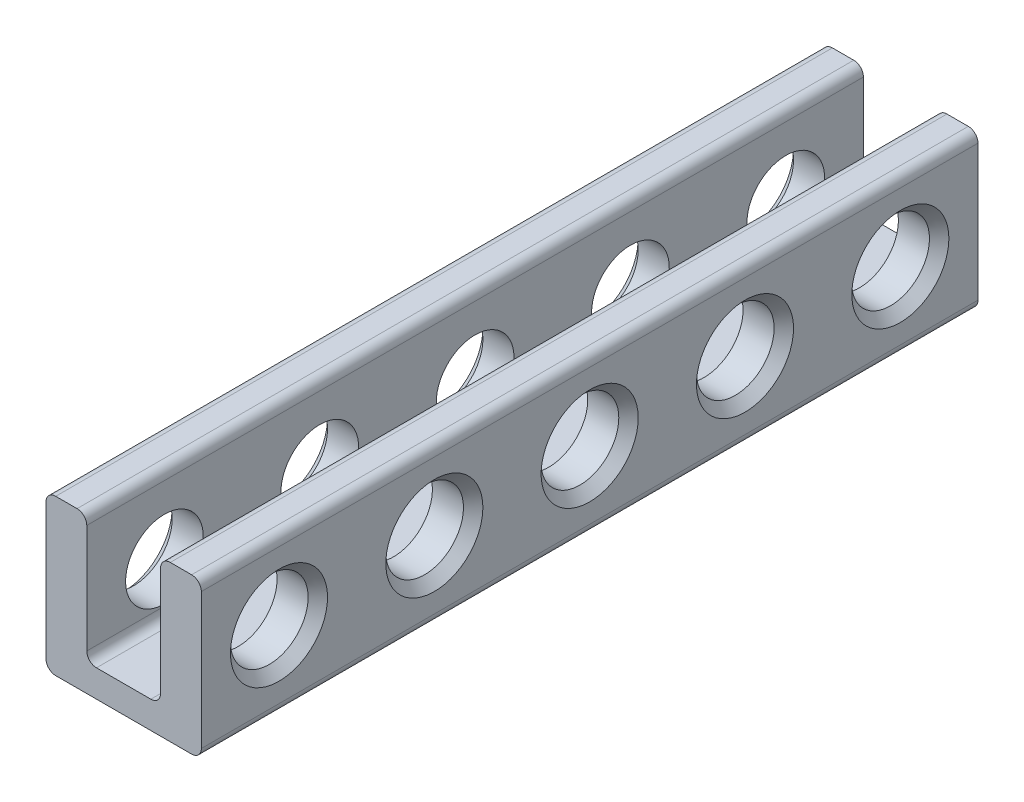
ISO-10303-21;
HEADER;
FILE_DESCRIPTION(('STEP AP214'),'2;1');
FILE_NAME('part.step','',(''),(''),'','','');
FILE_SCHEMA(('AUTOMOTIVE_DESIGN { 1 0 10303 214 1 1 1 1 }'));
ENDSEC;
DATA;
#1=APPLICATION_CONTEXT('core data for automotive mechanical design processes');
#2=APPLICATION_PROTOCOL_DEFINITION('international standard','automotive_design',2000,#1);
#3=PRODUCT_CONTEXT('',#1,'mechanical');
#4=PRODUCT('Part','Part','',(#3));
#5=PRODUCT_RELATED_PRODUCT_CATEGORY('part','',(#4));
#6=PRODUCT_DEFINITION_FORMATION('','',#4);
#7=PRODUCT_DEFINITION_CONTEXT('part definition',#1,'design');
#8=PRODUCT_DEFINITION('design','',#6,#7);
#9=PRODUCT_DEFINITION_SHAPE('','',#8);
#10=(LENGTH_UNIT() NAMED_UNIT(*) SI_UNIT(.MILLI.,.METRE.));
#11=(NAMED_UNIT(*) PLANE_ANGLE_UNIT() SI_UNIT($,.RADIAN.));
#12=(NAMED_UNIT(*) SI_UNIT($,.STERADIAN.) SOLID_ANGLE_UNIT());
#13=UNCERTAINTY_MEASURE_WITH_UNIT(LENGTH_MEASURE(1.E-05),#10,'distance_accuracy_value','');
#14=(GEOMETRIC_REPRESENTATION_CONTEXT(3) GLOBAL_UNCERTAINTY_ASSIGNED_CONTEXT((#13)) GLOBAL_UNIT_ASSIGNED_CONTEXT((#10,
#11,#12)) REPRESENTATION_CONTEXT('',''));
#15=CARTESIAN_POINT('',(0.,0.,0.));
#16=DIRECTION('',(0.,0.,1.));
#17=DIRECTION('',(1.,0.,0.));
#18=AXIS2_PLACEMENT_3D('',#15,#16,#17);
#19=CARTESIAN_POINT('',(4.,8.,40.));
#20=DIRECTION('',(0.,-1.,0.));
#21=DIRECTION('',(0.,0.,-1.));
#22=AXIS2_PLACEMENT_3D('',#19,#20,#21);
#23=PLANE('',#22);
#24=DIRECTION('',(0.,0.,1.));
#25=VECTOR('',#24,1.);
#26=CARTESIAN_POINT('',(-2.4,8.,-7.61577310586391));
#27=LINE('',#26,#25);
#28=CARTESIAN_POINT('',(-2.4,8.,0.));
#29=VERTEX_POINT('',#28);
#30=CARTESIAN_POINT('',(-2.4,8.,40.));
#31=VERTEX_POINT('',#30);
#32=EDGE_CURVE('E153',#29,#31,#27,.T.);
#33=ORIENTED_EDGE('',*,*,#32,.F.);
#34=DIRECTION('',(1.,0.,0.));
#35=VECTOR('',#34,1.);
#36=CARTESIAN_POINT('',(4.,8.,0.));
#37=LINE('',#36,#35);
#38=CARTESIAN_POINT('',(-3.5,8.,0.));
#39=VERTEX_POINT('',#38);
#40=EDGE_CURVE('E272',#39,#29,#37,.T.);
#41=ORIENTED_EDGE('',*,*,#40,.F.);
#42=DIRECTION('',(0.,0.,-1.));
#43=VECTOR('',#42,1.);
#44=CARTESIAN_POINT('',(-3.5,8.,40.));
#45=LINE('',#44,#43);
#46=CARTESIAN_POINT('',(-3.5,8.,40.));
#47=VERTEX_POINT('',#46);
#48=EDGE_CURVE('E163',#47,#39,#45,.T.);
#49=ORIENTED_EDGE('',*,*,#48,.F.);
#50=DIRECTION('',(1.,0.,0.));
#51=VECTOR('',#50,1.);
#52=CARTESIAN_POINT('',(4.,8.,40.));
#53=LINE('',#52,#51);
#54=EDGE_CURVE('E269',#31,#47,#53,.F.);
#55=ORIENTED_EDGE('',*,*,#54,.F.);
#56=EDGE_LOOP('',(#33,#41,#49,#55));
#57=FACE_BOUND('',#56,.T.);
#58=ADVANCED_FACE('F17',(#57),#23,.F.);
#59=CARTESIAN_POINT('',(4.,8.,40.));
#60=DIRECTION('',(0.,-1.,0.));
#61=DIRECTION('',(0.,0.,-1.));
#62=AXIS2_PLACEMENT_3D('',#59,#60,#61);
#63=PLANE('',#62);
#64=DIRECTION('',(0.,0.,1.));
#65=VECTOR('',#64,1.);
#66=CARTESIAN_POINT('',(2.4,8.,40.));
#67=LINE('',#66,#65);
#68=CARTESIAN_POINT('',(2.4,8.,40.));
#69=VERTEX_POINT('',#68);
#70=CARTESIAN_POINT('',(2.4,8.,0.));
#71=VERTEX_POINT('',#70);
#72=EDGE_CURVE('E127',#69,#71,#67,.F.);
#73=ORIENTED_EDGE('',*,*,#72,.F.);
#74=DIRECTION('',(1.,0.,0.));
#75=VECTOR('',#74,1.);
#76=CARTESIAN_POINT('',(4.,8.,40.));
#77=LINE('',#76,#75);
#78=CARTESIAN_POINT('',(3.5,8.,40.));
#79=VERTEX_POINT('',#78);
#80=EDGE_CURVE('E132',#79,#69,#77,.F.);
#81=ORIENTED_EDGE('',*,*,#80,.F.);
#82=DIRECTION('',(0.,0.,-1.));
#83=VECTOR('',#82,1.);
#84=CARTESIAN_POINT('',(3.5,8.,40.));
#85=LINE('',#84,#83);
#86=CARTESIAN_POINT('',(3.5,8.,0.));
#87=VERTEX_POINT('',#86);
#88=EDGE_CURVE('E129',#87,#79,#85,.F.);
#89=ORIENTED_EDGE('',*,*,#88,.F.);
#90=DIRECTION('',(1.,0.,0.));
#91=VECTOR('',#90,1.);
#92=CARTESIAN_POINT('',(4.,8.,0.));
#93=LINE('',#92,#91);
#94=EDGE_CURVE('E124',#71,#87,#93,.T.);
#95=ORIENTED_EDGE('',*,*,#94,.F.);
#96=EDGE_LOOP('',(#73,#81,#89,#95));
#97=FACE_BOUND('',#96,.T.);
#98=ADVANCED_FACE('F126',(#97),#63,.F.);
#99=CARTESIAN_POINT('',(-4.,4.,36.));
#100=DIRECTION('',(1.,0.,0.));
#101=DIRECTION('',(0.,1.,0.));
#102=AXIS2_PLACEMENT_3D('',#99,#100,#101);
#103=CYLINDRICAL_SURFACE('',#102,2.);
#104=CARTESIAN_POINT('',(1.9,4.,36.));
#105=DIRECTION('',(1.,0.,0.));
#106=DIRECTION('',(0.,1.,0.));
#107=AXIS2_PLACEMENT_3D('',#104,#105,#106);
#108=CIRCLE('',#107,2.);
#109=CARTESIAN_POINT('',(1.9,6.,36.));
#110=VERTEX_POINT('',#109);
#111=EDGE_CURVE('E173',#110,#110,#108,.F.);
#112=ORIENTED_EDGE('',*,*,#111,.T.);
#113=EDGE_LOOP('',(#112));
#114=FACE_BOUND('',#113,.T.);
#115=CARTESIAN_POINT('',(3.49999999991724,4.,36.));
#116=DIRECTION('',(1.,0.,0.));
#117=DIRECTION('',(0.,0.,-1.));
#118=AXIS2_PLACEMENT_3D('',#115,#116,#117);
#119=CIRCLE('',#118,2.0000000000082);
#120=CARTESIAN_POINT('',(3.49999999991724,4.,33.9999999999918));
#121=VERTEX_POINT('',#120);
#122=EDGE_CURVE('E285',#121,#121,#119,.T.);
#123=ORIENTED_EDGE('',*,*,#122,.T.);
#124=EDGE_LOOP('',(#123));
#125=FACE_BOUND('',#124,.T.);
#126=ADVANCED_FACE('F490',(#114,#125),#103,.F.);
#127=CARTESIAN_POINT('',(-4.,4.,28.));
#128=DIRECTION('',(1.,0.,0.));
#129=DIRECTION('',(0.,1.,0.));
#130=AXIS2_PLACEMENT_3D('',#127,#128,#129);
#131=CYLINDRICAL_SURFACE('',#130,2.);
#132=CARTESIAN_POINT('',(1.9,4.,28.));
#133=DIRECTION('',(1.,0.,0.));
#134=DIRECTION('',(0.,1.,0.));
#135=AXIS2_PLACEMENT_3D('',#132,#133,#134);
#136=CIRCLE('',#135,2.);
#137=CARTESIAN_POINT('',(1.9,6.,28.));
#138=VERTEX_POINT('',#137);
#139=EDGE_CURVE('E176',#138,#138,#136,.F.);
#140=ORIENTED_EDGE('',*,*,#139,.T.);
#141=EDGE_LOOP('',(#140));
#142=FACE_BOUND('',#141,.T.);
#143=CARTESIAN_POINT('',(3.49999999991724,4.,28.));
#144=DIRECTION('',(1.,0.,0.));
#145=DIRECTION('',(0.,0.,-1.));
#146=AXIS2_PLACEMENT_3D('',#143,#144,#145);
#147=CIRCLE('',#146,1.99999999998954);
#148=CARTESIAN_POINT('',(3.49999999991724,4.,26.0000000000105));
#149=VERTEX_POINT('',#148);
#150=EDGE_CURVE('E171',#149,#149,#147,.T.);
#151=ORIENTED_EDGE('',*,*,#150,.T.);
#152=EDGE_LOOP('',(#151));
#153=FACE_BOUND('',#152,.T.);
#154=ADVANCED_FACE('F486',(#142,#153),#131,.F.);
#155=CARTESIAN_POINT('',(-4.,4.,20.));
#156=DIRECTION('',(1.,0.,0.));
#157=DIRECTION('',(0.,1.,0.));
#158=AXIS2_PLACEMENT_3D('',#155,#156,#157);
#159=CYLINDRICAL_SURFACE('',#158,2.);
#160=CARTESIAN_POINT('',(1.9,4.,20.));
#161=DIRECTION('',(1.,0.,0.));
#162=DIRECTION('',(0.,1.,0.));
#163=AXIS2_PLACEMENT_3D('',#160,#161,#162);
#164=CIRCLE('',#163,2.);
#165=CARTESIAN_POINT('',(1.9,6.,20.));
#166=VERTEX_POINT('',#165);
#167=EDGE_CURVE('E179',#166,#166,#164,.F.);
#168=ORIENTED_EDGE('',*,*,#167,.T.);
#169=EDGE_LOOP('',(#168));
#170=FACE_BOUND('',#169,.T.);
#171=CARTESIAN_POINT('',(3.49999999991724,4.,20.));
#172=DIRECTION('',(1.,0.,0.));
#173=DIRECTION('',(0.,0.,-1.));
#174=AXIS2_PLACEMENT_3D('',#171,#172,#173);
#175=CIRCLE('',#174,2.00000000002774);
#176=CARTESIAN_POINT('',(3.49999999991724,4.,17.9999999999723));
#177=VERTEX_POINT('',#176);
#178=EDGE_CURVE('E282',#177,#177,#175,.T.);
#179=ORIENTED_EDGE('',*,*,#178,.T.);
#180=EDGE_LOOP('',(#179));
#181=FACE_BOUND('',#180,.T.);
#182=ADVANCED_FACE('F482',(#170,#181),#159,.F.);
#183=CARTESIAN_POINT('',(-4.,4.,12.));
#184=DIRECTION('',(1.,0.,0.));
#185=DIRECTION('',(0.,1.,0.));
#186=AXIS2_PLACEMENT_3D('',#183,#184,#185);
#187=CYLINDRICAL_SURFACE('',#186,2.);
#188=CARTESIAN_POINT('',(1.9,4.,12.));
#189=DIRECTION('',(1.,0.,0.));
#190=DIRECTION('',(0.,1.,0.));
#191=AXIS2_PLACEMENT_3D('',#188,#189,#190);
#192=CIRCLE('',#191,2.);
#193=CARTESIAN_POINT('',(1.9,6.,12.));
#194=VERTEX_POINT('',#193);
#195=EDGE_CURVE('E182',#194,#194,#192,.F.);
#196=ORIENTED_EDGE('',*,*,#195,.T.);
#197=EDGE_LOOP('',(#196));
#198=FACE_BOUND('',#197,.T.);
#199=CARTESIAN_POINT('',(3.49999999991724,4.,12.));
#200=DIRECTION('',(1.,0.,0.));
#201=DIRECTION('',(0.,0.,-1.));
#202=AXIS2_PLACEMENT_3D('',#199,#200,#201);
#203=CIRCLE('',#202,2.0000000000091);
#204=CARTESIAN_POINT('',(3.49999999991724,4.,9.99999999999091));
#205=VERTEX_POINT('',#204);
#206=EDGE_CURVE('E279',#205,#205,#203,.T.);
#207=ORIENTED_EDGE('',*,*,#206,.T.);
#208=EDGE_LOOP('',(#207));
#209=FACE_BOUND('',#208,.T.);
#210=ADVANCED_FACE('F478',(#198,#209),#187,.F.);
#211=CARTESIAN_POINT('',(-4.,4.,4.));
#212=DIRECTION('',(1.,0.,0.));
#213=DIRECTION('',(0.,1.,0.));
#214=AXIS2_PLACEMENT_3D('',#211,#212,#213);
#215=CYLINDRICAL_SURFACE('',#214,2.);
#216=CARTESIAN_POINT('',(1.9,4.,4.));
#217=DIRECTION('',(1.,0.,0.));
#218=DIRECTION('',(0.,1.,0.));
#219=AXIS2_PLACEMENT_3D('',#216,#217,#218);
#220=CIRCLE('',#219,2.);
#221=CARTESIAN_POINT('',(1.9,6.,4.));
#222=VERTEX_POINT('',#221);
#223=EDGE_CURVE('E185',#222,#222,#220,.F.);
#224=ORIENTED_EDGE('',*,*,#223,.T.);
#225=EDGE_LOOP('',(#224));
#226=FACE_BOUND('',#225,.T.);
#227=CARTESIAN_POINT('',(3.49999999991724,4.,4.));
#228=DIRECTION('',(1.,0.,0.));
#229=DIRECTION('',(0.,0.,-1.));
#230=AXIS2_PLACEMENT_3D('',#227,#228,#229);
#231=CIRCLE('',#230,1.99999999999045);
#232=CARTESIAN_POINT('',(3.49999999991724,4.,2.00000000000955));
#233=VERTEX_POINT('',#232);
#234=EDGE_CURVE('E167',#233,#233,#231,.T.);
#235=ORIENTED_EDGE('',*,*,#234,.T.);
#236=EDGE_LOOP('',(#235));
#237=FACE_BOUND('',#236,.T.);
#238=ADVANCED_FACE('F475',(#226,#237),#215,.F.);
#239=CARTESIAN_POINT('',(2.4,7.5,40.));
#240=DIRECTION('',(0.,0.,1.));
#241=DIRECTION('',(1.,0.,0.));
#242=AXIS2_PLACEMENT_3D('',#239,#240,#241);
#243=CYLINDRICAL_SURFACE('',#242,0.5);
#244=CARTESIAN_POINT('',(2.4,7.5,40.));
#245=DIRECTION('',(0.,0.,1.));
#246=DIRECTION('',(1.,0.,0.));
#247=AXIS2_PLACEMENT_3D('',#244,#245,#246);
#248=CIRCLE('',#247,0.5);
#249=CARTESIAN_POINT('',(1.9,7.5,40.));
#250=VERTEX_POINT('',#249);
#251=EDGE_CURVE('E139',#250,#69,#248,.F.);
#252=ORIENTED_EDGE('',*,*,#251,.T.);
#253=ORIENTED_EDGE('',*,*,#72,.T.);
#254=CARTESIAN_POINT('',(2.4,7.5,0.));
#255=DIRECTION('',(0.,0.,1.));
#256=DIRECTION('',(1.,0.,0.));
#257=AXIS2_PLACEMENT_3D('',#254,#255,#256);
#258=CIRCLE('',#257,0.5);
#259=CARTESIAN_POINT('',(1.9,7.5,0.));
#260=VERTEX_POINT('',#259);
#261=EDGE_CURVE('E20',#71,#260,#258,.T.);
#262=ORIENTED_EDGE('',*,*,#261,.T.);
#263=DIRECTION('',(0.,0.,1.));
#264=VECTOR('',#263,1.);
#265=CARTESIAN_POINT('',(1.9,7.5,-7.61577310586391));
#266=LINE('',#265,#264);
#267=EDGE_CURVE('E188',#260,#250,#266,.T.);
#268=ORIENTED_EDGE('',*,*,#267,.T.);
#269=EDGE_LOOP('',(#252,#253,#262,#268));
#270=FACE_BOUND('',#269,.T.);
#271=ADVANCED_FACE('F136',(#270),#243,.T.);
#272=CARTESIAN_POINT('',(1.4,1.9,-7.61577310586391));
#273=DIRECTION('',(0.,0.,-1.));
#274=DIRECTION('',(-1.,0.,0.));
#275=AXIS2_PLACEMENT_3D('',#272,#273,#274);
#276=CYLINDRICAL_SURFACE('',#275,0.5);
#277=DIRECTION('',(0.,0.,-1.));
#278=VECTOR('',#277,1.);
#279=CARTESIAN_POINT('',(1.4,1.4,-7.61577310586391));
#280=LINE('',#279,#278);
#281=CARTESIAN_POINT('',(1.4,1.4,0.));
#282=VERTEX_POINT('',#281);
#283=CARTESIAN_POINT('',(1.4,1.4,40.));
#284=VERTEX_POINT('',#283);
#285=EDGE_CURVE('E193',#282,#284,#280,.F.);
#286=ORIENTED_EDGE('',*,*,#285,.T.);
#287=CARTESIAN_POINT('',(1.4,1.9,40.));
#288=DIRECTION('',(0.,0.,-1.));
#289=DIRECTION('',(-1.,0.,0.));
#290=AXIS2_PLACEMENT_3D('',#287,#288,#289);
#291=CIRCLE('',#290,0.5);
#292=CARTESIAN_POINT('',(1.9,1.9,40.));
#293=VERTEX_POINT('',#292);
#294=EDGE_CURVE('E141',#293,#284,#291,.T.);
#295=ORIENTED_EDGE('',*,*,#294,.F.);
#296=DIRECTION('',(0.,0.,1.));
#297=VECTOR('',#296,1.);
#298=CARTESIAN_POINT('',(1.9,1.9,-7.61577310586391));
#299=LINE('',#298,#297);
#300=CARTESIAN_POINT('',(1.9,1.9,0.));
#301=VERTEX_POINT('',#300);
#302=EDGE_CURVE('E292',#293,#301,#299,.F.);
#303=ORIENTED_EDGE('',*,*,#302,.T.);
#304=CARTESIAN_POINT('',(1.4,1.9,0.));
#305=DIRECTION('',(0.,0.,-1.));
#306=DIRECTION('',(-1.,0.,0.));
#307=AXIS2_PLACEMENT_3D('',#304,#305,#306);
#308=CIRCLE('',#307,0.5);
#309=EDGE_CURVE('E149',#282,#301,#308,.F.);
#310=ORIENTED_EDGE('',*,*,#309,.F.);
#311=EDGE_LOOP('',(#286,#295,#303,#310));
#312=FACE_BOUND('',#311,.T.);
#313=ADVANCED_FACE('F468',(#312),#276,.F.);
#314=CARTESIAN_POINT('',(-4.,4.,36.));
#315=DIRECTION('',(1.,0.,0.));
#316=DIRECTION('',(0.,1.,0.));
#317=AXIS2_PLACEMENT_3D('',#314,#315,#316);
#318=CYLINDRICAL_SURFACE('',#317,2.);
#319=CARTESIAN_POINT('',(-1.9,4.,36.));
#320=DIRECTION('',(1.,0.,0.));
#321=DIRECTION('',(0.,1.,0.));
#322=AXIS2_PLACEMENT_3D('',#319,#320,#321);
#323=CIRCLE('',#322,2.);
#324=CARTESIAN_POINT('',(-1.9,6.,36.));
#325=VERTEX_POINT('',#324);
#326=EDGE_CURVE('E189',#325,#325,#323,.T.);
#327=ORIENTED_EDGE('',*,*,#326,.T.);
#328=EDGE_LOOP('',(#327));
#329=FACE_BOUND('',#328,.T.);
#330=CARTESIAN_POINT('',(-3.49999999997408,4.,36.));
#331=DIRECTION('',(-1.,0.,0.));
#332=DIRECTION('',(0.,0.,1.));
#333=AXIS2_PLACEMENT_3D('',#330,#331,#332);
#334=CIRCLE('',#333,2.0000000000109);
#335=CARTESIAN_POINT('',(-3.49999999997408,4.,38.0000000000109));
#336=VERTEX_POINT('',#335);
#337=EDGE_CURVE('E264',#336,#336,#334,.T.);
#338=ORIENTED_EDGE('',*,*,#337,.T.);
#339=EDGE_LOOP('',(#338));
#340=FACE_BOUND('',#339,.T.);
#341=ADVANCED_FACE('F464',(#329,#340),#318,.F.);
#342=CARTESIAN_POINT('',(-4.,4.,28.));
#343=DIRECTION('',(1.,0.,0.));
#344=DIRECTION('',(0.,1.,0.));
#345=AXIS2_PLACEMENT_3D('',#342,#343,#344);
#346=CYLINDRICAL_SURFACE('',#345,2.);
#347=CARTESIAN_POINT('',(-1.9,4.,28.));
#348=DIRECTION('',(1.,0.,0.));
#349=DIRECTION('',(0.,1.,0.));
#350=AXIS2_PLACEMENT_3D('',#347,#348,#349);
#351=CIRCLE('',#350,2.);
#352=CARTESIAN_POINT('',(-1.9,6.,28.));
#353=VERTEX_POINT('',#352);
#354=EDGE_CURVE('E192',#353,#353,#351,.T.);
#355=ORIENTED_EDGE('',*,*,#354,.T.);
#356=EDGE_LOOP('',(#355));
#357=FACE_BOUND('',#356,.T.);
#358=CARTESIAN_POINT('',(-3.50000000003092,4.,28.));
#359=DIRECTION('',(-1.,0.,0.));
#360=DIRECTION('',(0.,0.,1.));
#361=AXIS2_PLACEMENT_3D('',#358,#359,#360);
#362=CIRCLE('',#361,2.00000000002955);
#363=CARTESIAN_POINT('',(-3.50000000003092,4.,30.0000000000296));
#364=VERTEX_POINT('',#363);
#365=EDGE_CURVE('E164',#364,#364,#362,.T.);
#366=ORIENTED_EDGE('',*,*,#365,.T.);
#367=EDGE_LOOP('',(#366));
#368=FACE_BOUND('',#367,.T.);
#369=ADVANCED_FACE('F460',(#357,#368),#346,.F.);
#370=CARTESIAN_POINT('',(-4.,4.,20.));
#371=DIRECTION('',(1.,0.,0.));
#372=DIRECTION('',(0.,1.,0.));
#373=AXIS2_PLACEMENT_3D('',#370,#371,#372);
#374=CYLINDRICAL_SURFACE('',#373,2.);
#375=CARTESIAN_POINT('',(-1.9,4.,20.));
#376=DIRECTION('',(1.,0.,0.));
#377=DIRECTION('',(0.,1.,0.));
#378=AXIS2_PLACEMENT_3D('',#375,#376,#377);
#379=CIRCLE('',#378,2.);
#380=CARTESIAN_POINT('',(-1.9,6.,20.));
#381=VERTEX_POINT('',#380);
#382=EDGE_CURVE('E196',#381,#381,#379,.T.);
#383=ORIENTED_EDGE('',*,*,#382,.T.);
#384=EDGE_LOOP('',(#383));
#385=FACE_BOUND('',#384,.T.);
#386=CARTESIAN_POINT('',(-3.49999999997408,4.,20.));
#387=DIRECTION('',(-1.,0.,0.));
#388=DIRECTION('',(0.,0.,1.));
#389=AXIS2_PLACEMENT_3D('',#386,#387,#388);
#390=CIRCLE('',#389,1.99999999993451);
#391=CARTESIAN_POINT('',(-3.49999999997408,4.,21.9999999999345));
#392=VERTEX_POINT('',#391);
#393=EDGE_CURVE('E261',#392,#392,#390,.T.);
#394=ORIENTED_EDGE('',*,*,#393,.T.);
#395=EDGE_LOOP('',(#394));
#396=FACE_BOUND('',#395,.T.);
#397=ADVANCED_FACE('F456',(#385,#396),#374,.F.);
#398=CARTESIAN_POINT('',(-4.,4.,12.));
#399=DIRECTION('',(1.,0.,0.));
#400=DIRECTION('',(0.,1.,0.));
#401=AXIS2_PLACEMENT_3D('',#398,#399,#400);
#402=CYLINDRICAL_SURFACE('',#401,2.);
#403=CARTESIAN_POINT('',(-1.9,4.,12.));
#404=DIRECTION('',(1.,0.,0.));
#405=DIRECTION('',(0.,1.,0.));
#406=AXIS2_PLACEMENT_3D('',#403,#404,#405);
#407=CIRCLE('',#406,2.);
#408=CARTESIAN_POINT('',(-1.9,6.,12.));
#409=VERTEX_POINT('',#408);
#410=EDGE_CURVE('E199',#409,#409,#407,.T.);
#411=ORIENTED_EDGE('',*,*,#410,.T.);
#412=EDGE_LOOP('',(#411));
#413=FACE_BOUND('',#412,.T.);
#414=CARTESIAN_POINT('',(-3.49999999997408,4.,12.));
#415=DIRECTION('',(-1.,0.,0.));
#416=DIRECTION('',(0.,0.,1.));
#417=AXIS2_PLACEMENT_3D('',#414,#415,#416);
#418=CIRCLE('',#417,1.99999999995316);
#419=CARTESIAN_POINT('',(-3.49999999997408,4.,13.9999999999532));
#420=VERTEX_POINT('',#419);
#421=EDGE_CURVE('E258',#420,#420,#418,.T.);
#422=ORIENTED_EDGE('',*,*,#421,.T.);
#423=EDGE_LOOP('',(#422));
#424=FACE_BOUND('',#423,.T.);
#425=ADVANCED_FACE('F452',(#413,#424),#402,.F.);
#426=CARTESIAN_POINT('',(-4.,4.,4.));
#427=DIRECTION('',(1.,0.,0.));
#428=DIRECTION('',(0.,1.,0.));
#429=AXIS2_PLACEMENT_3D('',#426,#427,#428);
#430=CYLINDRICAL_SURFACE('',#429,2.);
#431=CARTESIAN_POINT('',(-1.9,4.,4.));
#432=DIRECTION('',(1.,0.,0.));
#433=DIRECTION('',(0.,1.,0.));
#434=AXIS2_PLACEMENT_3D('',#431,#432,#433);
#435=CIRCLE('',#434,2.);
#436=CARTESIAN_POINT('',(-1.9,6.,4.));
#437=VERTEX_POINT('',#436);
#438=EDGE_CURVE('E202',#437,#437,#435,.T.);
#439=ORIENTED_EDGE('',*,*,#438,.T.);
#440=EDGE_LOOP('',(#439));
#441=FACE_BOUND('',#440,.T.);
#442=CARTESIAN_POINT('',(-3.50000000003092,4.,4.));
#443=DIRECTION('',(-1.,0.,0.));
#444=DIRECTION('',(0.,0.,1.));
#445=AXIS2_PLACEMENT_3D('',#442,#443,#444);
#446=CIRCLE('',#445,2.00000000002865);
#447=CARTESIAN_POINT('',(-3.50000000003092,4.,6.00000000002865));
#448=VERTEX_POINT('',#447);
#449=EDGE_CURVE('E160',#448,#448,#446,.T.);
#450=ORIENTED_EDGE('',*,*,#449,.T.);
#451=EDGE_LOOP('',(#450));
#452=FACE_BOUND('',#451,.T.);
#453=ADVANCED_FACE('F448',(#441,#452),#430,.F.);
#454=CARTESIAN_POINT('',(-2.4,7.5,-7.61577310586391));
#455=DIRECTION('',(0.,0.,1.));
#456=DIRECTION('',(1.,0.,0.));
#457=AXIS2_PLACEMENT_3D('',#454,#455,#456);
#458=CYLINDRICAL_SURFACE('',#457,0.5);
#459=CARTESIAN_POINT('',(-2.4,7.5,40.));
#460=DIRECTION('',(0.,0.,1.));
#461=DIRECTION('',(1.,0.,0.));
#462=AXIS2_PLACEMENT_3D('',#459,#460,#461);
#463=CIRCLE('',#462,0.5);
#464=CARTESIAN_POINT('',(-1.9,7.5,40.));
#465=VERTEX_POINT('',#464);
#466=EDGE_CURVE('E154',#31,#465,#463,.F.);
#467=ORIENTED_EDGE('',*,*,#466,.T.);
#468=DIRECTION('',(0.,0.,1.));
#469=VECTOR('',#468,1.);
#470=CARTESIAN_POINT('',(-1.9,7.5,-7.61577310586391));
#471=LINE('',#470,#469);
#472=CARTESIAN_POINT('',(-1.9,7.5,0.));
#473=VERTEX_POINT('',#472);
#474=EDGE_CURVE('E205',#465,#473,#471,.F.);
#475=ORIENTED_EDGE('',*,*,#474,.T.);
#476=CARTESIAN_POINT('',(-2.4,7.5,0.));
#477=DIRECTION('',(0.,0.,1.));
#478=DIRECTION('',(1.,0.,0.));
#479=AXIS2_PLACEMENT_3D('',#476,#477,#478);
#480=CIRCLE('',#479,0.5);
#481=EDGE_CURVE('E151',#473,#29,#480,.T.);
#482=ORIENTED_EDGE('',*,*,#481,.T.);
#483=ORIENTED_EDGE('',*,*,#32,.T.);
#484=EDGE_LOOP('',(#467,#475,#482,#483));
#485=FACE_BOUND('',#484,.T.);
#486=ADVANCED_FACE('F444',(#485),#458,.T.);
#487=CARTESIAN_POINT('',(-1.4,1.9,-7.61577310586391));
#488=DIRECTION('',(0.,0.,-1.));
#489=DIRECTION('',(-1.,0.,0.));
#490=AXIS2_PLACEMENT_3D('',#487,#488,#489);
#491=CYLINDRICAL_SURFACE('',#490,0.5);
#492=DIRECTION('',(0.,0.,1.));
#493=VECTOR('',#492,1.);
#494=CARTESIAN_POINT('',(-1.9,1.9,-7.61577310586391));
#495=LINE('',#494,#493);
#496=CARTESIAN_POINT('',(-1.9,1.9,0.));
#497=VERTEX_POINT('',#496);
#498=CARTESIAN_POINT('',(-1.9,1.9,40.));
#499=VERTEX_POINT('',#498);
#500=EDGE_CURVE('E210',#497,#499,#495,.T.);
#501=ORIENTED_EDGE('',*,*,#500,.T.);
#502=CARTESIAN_POINT('',(-1.4,1.9,40.));
#503=DIRECTION('',(0.,0.,-1.));
#504=DIRECTION('',(-1.,0.,0.));
#505=AXIS2_PLACEMENT_3D('',#502,#503,#504);
#506=CIRCLE('',#505,0.5);
#507=CARTESIAN_POINT('',(-1.4,1.4,40.));
#508=VERTEX_POINT('',#507);
#509=EDGE_CURVE('E156',#508,#499,#506,.T.);
#510=ORIENTED_EDGE('',*,*,#509,.F.);
#511=DIRECTION('',(0.,0.,-1.));
#512=VECTOR('',#511,1.);
#513=CARTESIAN_POINT('',(-1.4,1.4,-7.61577310586391));
#514=LINE('',#513,#512);
#515=CARTESIAN_POINT('',(-1.4,1.4,0.));
#516=VERTEX_POINT('',#515);
#517=EDGE_CURVE('E295',#508,#516,#514,.T.);
#518=ORIENTED_EDGE('',*,*,#517,.T.);
#519=CARTESIAN_POINT('',(-1.4,1.9,0.));
#520=DIRECTION('',(0.,0.,-1.));
#521=DIRECTION('',(-1.,0.,0.));
#522=AXIS2_PLACEMENT_3D('',#519,#520,#521);
#523=CIRCLE('',#522,0.5);
#524=EDGE_CURVE('E158',#497,#516,#523,.F.);
#525=ORIENTED_EDGE('',*,*,#524,.F.);
#526=EDGE_LOOP('',(#501,#510,#518,#525));
#527=FACE_BOUND('',#526,.T.);
#528=ADVANCED_FACE('F440',(#527),#491,.F.);
#529=CARTESIAN_POINT('',(-3.99999999990541,4.,4.));
#530=DIRECTION('',(-1.,0.,0.));
#531=DIRECTION('',(0.,0.,1.));
#532=AXIS2_PLACEMENT_3D('',#529,#530,#531);
#533=CONICAL_SURFACE('',#532,2.49999999995998,0.785398163454292);
#534=CARTESIAN_POINT('',(-3.99999999994316,4.,4.));
#535=DIRECTION('',(-1.,0.,0.));
#536=DIRECTION('',(0.,0.,1.));
#537=AXIS2_PLACEMENT_3D('',#534,#535,#536);
#538=CIRCLE('',#537,2.49999999999773);
#539=CARTESIAN_POINT('',(-3.99999999994316,4.,6.49999999999773));
#540=VERTEX_POINT('',#539);
#541=EDGE_CURVE('E206',#540,#540,#538,.T.);
#542=ORIENTED_EDGE('',*,*,#541,.T.);
#543=EDGE_LOOP('',(#542));
#544=FACE_BOUND('',#543,.T.);
#545=ORIENTED_EDGE('',*,*,#449,.F.);
#546=EDGE_LOOP('',(#545));
#547=FACE_BOUND('',#546,.T.);
#548=ADVANCED_FACE('F436',(#544,#547),#533,.F.);
#549=CARTESIAN_POINT('',(-3.99999999990541,4.,12.));
#550=DIRECTION('',(-1.,0.,0.));
#551=DIRECTION('',(0.,0.,1.));
#552=AXIS2_PLACEMENT_3D('',#549,#550,#551);
#553=CONICAL_SURFACE('',#552,2.49999999988449,0.785398163397448);
#554=CARTESIAN_POINT('',(-3.99999999996226,4.,12.));
#555=DIRECTION('',(-1.,0.,0.));
#556=DIRECTION('',(0.,0.,1.));
#557=AXIS2_PLACEMENT_3D('',#554,#555,#556);
#558=CIRCLE('',#557,2.49999999994133);
#559=CARTESIAN_POINT('',(-3.99999999996226,4.,14.4999999999413));
#560=VERTEX_POINT('',#559);
#561=EDGE_CURVE('E209',#560,#560,#558,.T.);
#562=ORIENTED_EDGE('',*,*,#561,.T.);
#563=EDGE_LOOP('',(#562));
#564=FACE_BOUND('',#563,.T.);
#565=ORIENTED_EDGE('',*,*,#421,.F.);
#566=EDGE_LOOP('',(#565));
#567=FACE_BOUND('',#566,.T.);
#568=ADVANCED_FACE('F432',(#564,#567),#553,.F.);
#569=CARTESIAN_POINT('',(-3.99999999990541,4.,20.));
#570=DIRECTION('',(-1.,0.,0.));
#571=DIRECTION('',(0.,0.,1.));
#572=AXIS2_PLACEMENT_3D('',#569,#570,#571);
#573=CONICAL_SURFACE('',#572,2.49999999986585,0.785398163397448);
#574=CARTESIAN_POINT('',(-3.99999999996226,4.,20.));
#575=DIRECTION('',(-1.,0.,0.));
#576=DIRECTION('',(0.,0.,1.));
#577=AXIS2_PLACEMENT_3D('',#574,#575,#576);
#578=CIRCLE('',#577,2.49999999992269);
#579=CARTESIAN_POINT('',(-3.99999999996226,4.,22.4999999999227));
#580=VERTEX_POINT('',#579);
#581=EDGE_CURVE('E213',#580,#580,#578,.T.);
#582=ORIENTED_EDGE('',*,*,#581,.T.);
#583=EDGE_LOOP('',(#582));
#584=FACE_BOUND('',#583,.T.);
#585=ORIENTED_EDGE('',*,*,#393,.F.);
#586=EDGE_LOOP('',(#585));
#587=FACE_BOUND('',#586,.T.);
#588=ADVANCED_FACE('F428',(#584,#587),#573,.F.);
#589=CARTESIAN_POINT('',(-3.99999999996226,4.,36.));
#590=DIRECTION('',(-1.,0.,0.));
#591=DIRECTION('',(0.,0.,1.));
#592=AXIS2_PLACEMENT_3D('',#589,#590,#591);
#593=CONICAL_SURFACE('',#592,2.49999999999908,0.785398163397448);
#594=CARTESIAN_POINT('',(-3.99999999996226,4.,36.));
#595=DIRECTION('',(-1.,0.,0.));
#596=DIRECTION('',(0.,0.,1.));
#597=AXIS2_PLACEMENT_3D('',#594,#595,#596);
#598=CIRCLE('',#597,2.49999999999908);
#599=CARTESIAN_POINT('',(-3.99999999996226,4.,38.4999999999991));
#600=VERTEX_POINT('',#599);
#601=EDGE_CURVE('E216',#600,#600,#598,.T.);
#602=ORIENTED_EDGE('',*,*,#601,.T.);
#603=EDGE_LOOP('',(#602));
#604=FACE_BOUND('',#603,.T.);
#605=ORIENTED_EDGE('',*,*,#337,.F.);
#606=EDGE_LOOP('',(#605));
#607=FACE_BOUND('',#606,.T.);
#608=ADVANCED_FACE('F424',(#604,#607),#593,.F.);
#609=CARTESIAN_POINT('',(-3.99999999996226,4.,28.));
#610=DIRECTION('',(-1.,0.,0.));
#611=DIRECTION('',(0.,0.,1.));
#612=AXIS2_PLACEMENT_3D('',#609,#610,#611);
#613=CONICAL_SURFACE('',#612,2.49999999996089,0.785398163340605);
#614=CARTESIAN_POINT('',(-3.99999999996226,4.,28.));
#615=DIRECTION('',(-1.,0.,0.));
#616=DIRECTION('',(0.,0.,1.));
#617=AXIS2_PLACEMENT_3D('',#614,#615,#616);
#618=CIRCLE('',#617,2.49999999996089);
#619=CARTESIAN_POINT('',(-3.99999999996226,4.,30.4999999999609));
#620=VERTEX_POINT('',#619);
#621=EDGE_CURVE('E219',#620,#620,#618,.T.);
#622=ORIENTED_EDGE('',*,*,#621,.T.);
#623=EDGE_LOOP('',(#622));
#624=FACE_BOUND('',#623,.T.);
#625=ORIENTED_EDGE('',*,*,#365,.F.);
#626=EDGE_LOOP('',(#625));
#627=FACE_BOUND('',#626,.T.);
#628=ADVANCED_FACE('F420',(#624,#627),#613,.F.);
#629=CARTESIAN_POINT('',(-3.5,7.5,40.));
#630=DIRECTION('',(0.,0.,-1.));
#631=DIRECTION('',(-1.,0.,0.));
#632=AXIS2_PLACEMENT_3D('',#629,#630,#631);
#633=CYLINDRICAL_SURFACE('',#632,0.5);
#634=CARTESIAN_POINT('',(-3.5,7.5,0.));
#635=DIRECTION('',(0.,0.,-1.));
#636=DIRECTION('',(-1.,0.,0.));
#637=AXIS2_PLACEMENT_3D('',#634,#635,#636);
#638=CIRCLE('',#637,0.5);
#639=CARTESIAN_POINT('',(-4.,7.5,0.));
#640=VERTEX_POINT('',#639);
#641=EDGE_CURVE('E165',#39,#640,#638,.F.);
#642=ORIENTED_EDGE('',*,*,#641,.T.);
#643=DIRECTION('',(0.,0.,1.));
#644=VECTOR('',#643,1.);
#645=CARTESIAN_POINT('',(-4.,7.5,40.));
#646=LINE('',#645,#644);
#647=CARTESIAN_POINT('',(-4.,7.5,40.));
#648=VERTEX_POINT('',#647);
#649=EDGE_CURVE('E222',#640,#648,#646,.T.);
#650=ORIENTED_EDGE('',*,*,#649,.T.);
#651=CARTESIAN_POINT('',(-3.5,7.5,40.));
#652=DIRECTION('',(0.,0.,-1.));
#653=DIRECTION('',(-1.,0.,0.));
#654=AXIS2_PLACEMENT_3D('',#651,#652,#653);
#655=CIRCLE('',#654,0.5);
#656=EDGE_CURVE('E161',#648,#47,#655,.T.);
#657=ORIENTED_EDGE('',*,*,#656,.T.);
#658=ORIENTED_EDGE('',*,*,#48,.T.);
#659=EDGE_LOOP('',(#642,#650,#657,#658));
#660=FACE_BOUND('',#659,.T.);
#661=ADVANCED_FACE('F416',(#660),#633,.T.);
#662=CARTESIAN_POINT('',(4.0000000000191,4.,4.));
#663=DIRECTION('',(1.,0.,0.));
#664=DIRECTION('',(0.,0.,-1.));
#665=AXIS2_PLACEMENT_3D('',#662,#663,#664);
#666=CONICAL_SURFACE('',#665,2.50000000009232,0.785398163397448);
#667=CARTESIAN_POINT('',(3.99999999996226,4.,4.));
#668=DIRECTION('',(1.,0.,0.));
#669=DIRECTION('',(0.,0.,-1.));
#670=AXIS2_PLACEMENT_3D('',#667,#668,#669);
#671=CIRCLE('',#670,2.50000000003547);
#672=CARTESIAN_POINT('',(3.99999999996226,4.,1.49999999996453));
#673=VERTEX_POINT('',#672);
#674=EDGE_CURVE('E223',#673,#673,#671,.T.);
#675=ORIENTED_EDGE('',*,*,#674,.T.);
#676=EDGE_LOOP('',(#675));
#677=FACE_BOUND('',#676,.T.);
#678=ORIENTED_EDGE('',*,*,#234,.F.);
#679=EDGE_LOOP('',(#678));
#680=FACE_BOUND('',#679,.T.);
#681=ADVANCED_FACE('F412',(#677,#680),#666,.F.);
#682=CARTESIAN_POINT('',(4.0000000000191,4.,12.));
#683=DIRECTION('',(1.,0.,0.));
#684=DIRECTION('',(0.,0.,-1.));
#685=AXIS2_PLACEMENT_3D('',#682,#683,#684);
#686=CONICAL_SURFACE('',#685,2.50000000011096,0.785398163397448);
#687=CARTESIAN_POINT('',(3.99999999996226,4.,12.));
#688=DIRECTION('',(1.,0.,0.));
#689=DIRECTION('',(0.,0.,-1.));
#690=AXIS2_PLACEMENT_3D('',#687,#688,#689);
#691=CIRCLE('',#690,2.50000000005412);
#692=CARTESIAN_POINT('',(3.99999999996226,4.,9.49999999994589));
#693=VERTEX_POINT('',#692);
#694=EDGE_CURVE('E226',#693,#693,#691,.T.);
#695=ORIENTED_EDGE('',*,*,#694,.T.);
#696=EDGE_LOOP('',(#695));
#697=FACE_BOUND('',#696,.T.);
#698=ORIENTED_EDGE('',*,*,#206,.F.);
#699=EDGE_LOOP('',(#698));
#700=FACE_BOUND('',#699,.T.);
#701=ADVANCED_FACE('F408',(#697,#700),#686,.F.);
#702=CARTESIAN_POINT('',(4.0000000000191,4.,20.));
#703=DIRECTION('',(1.,0.,0.));
#704=DIRECTION('',(0.,0.,-1.));
#705=AXIS2_PLACEMENT_3D('',#702,#703,#704);
#706=CONICAL_SURFACE('',#705,2.50000000012961,0.785398163397448);
#707=CARTESIAN_POINT('',(3.99999999996226,4.,20.));
#708=DIRECTION('',(1.,0.,0.));
#709=DIRECTION('',(0.,0.,-1.));
#710=AXIS2_PLACEMENT_3D('',#707,#708,#709);
#711=CIRCLE('',#710,2.50000000007276);
#712=CARTESIAN_POINT('',(3.99999999996226,4.,17.4999999999272));
#713=VERTEX_POINT('',#712);
#714=EDGE_CURVE('E229',#713,#713,#711,.T.);
#715=ORIENTED_EDGE('',*,*,#714,.T.);
#716=EDGE_LOOP('',(#715));
#717=FACE_BOUND('',#716,.T.);
#718=ORIENTED_EDGE('',*,*,#178,.F.);
#719=EDGE_LOOP('',(#718));
#720=FACE_BOUND('',#719,.T.);
#721=ADVANCED_FACE('F404',(#717,#720),#706,.F.);
#722=CARTESIAN_POINT('',(4.0000000000191,4.,36.));
#723=DIRECTION('',(1.,0.,0.));
#724=DIRECTION('',(0.,0.,-1.));
#725=AXIS2_PLACEMENT_3D('',#722,#723,#724);
#726=CONICAL_SURFACE('',#725,2.50000000011006,0.785398163397448);
#727=CARTESIAN_POINT('',(3.99999999996226,4.,36.));
#728=DIRECTION('',(1.,0.,0.));
#729=DIRECTION('',(0.,0.,-1.));
#730=AXIS2_PLACEMENT_3D('',#727,#728,#729);
#731=CIRCLE('',#730,2.50000000005322);
#732=CARTESIAN_POINT('',(3.99999999996226,4.,33.4999999999468));
#733=VERTEX_POINT('',#732);
#734=EDGE_CURVE('E232',#733,#733,#731,.T.);
#735=ORIENTED_EDGE('',*,*,#734,.T.);
#736=EDGE_LOOP('',(#735));
#737=FACE_BOUND('',#736,.T.);
#738=ORIENTED_EDGE('',*,*,#122,.F.);
#739=EDGE_LOOP('',(#738));
#740=FACE_BOUND('',#739,.T.);
#741=ADVANCED_FACE('F397',(#737,#740),#726,.F.);
#742=CARTESIAN_POINT('',(4.0000000000191,4.,28.));
#743=DIRECTION('',(1.,0.,0.));
#744=DIRECTION('',(0.,0.,-1.));
#745=AXIS2_PLACEMENT_3D('',#742,#743,#744);
#746=CONICAL_SURFACE('',#745,2.50000000009141,0.785398163397448);
#747=CARTESIAN_POINT('',(3.99999999996226,4.,28.));
#748=DIRECTION('',(1.,0.,0.));
#749=DIRECTION('',(0.,0.,-1.));
#750=AXIS2_PLACEMENT_3D('',#747,#748,#749);
#751=CIRCLE('',#750,2.50000000003456);
#752=CARTESIAN_POINT('',(3.99999999996226,4.,25.4999999999654));
#753=VERTEX_POINT('',#752);
#754=EDGE_CURVE('E235',#753,#753,#751,.T.);
#755=ORIENTED_EDGE('',*,*,#754,.T.);
#756=EDGE_LOOP('',(#755));
#757=FACE_BOUND('',#756,.T.);
#758=ORIENTED_EDGE('',*,*,#150,.F.);
#759=EDGE_LOOP('',(#758));
#760=FACE_BOUND('',#759,.T.);
#761=ADVANCED_FACE('F388',(#757,#760),#746,.F.);
#762=CARTESIAN_POINT('',(3.5,7.5,40.));
#763=DIRECTION('',(0.,0.,-1.));
#764=DIRECTION('',(-1.,0.,0.));
#765=AXIS2_PLACEMENT_3D('',#762,#763,#764);
#766=CYLINDRICAL_SURFACE('',#765,0.5);
#767=CARTESIAN_POINT('',(3.5,7.5,0.));
#768=DIRECTION('',(0.,0.,-1.));
#769=DIRECTION('',(-1.,0.,0.));
#770=AXIS2_PLACEMENT_3D('',#767,#768,#769);
#771=CIRCLE('',#770,0.5);
#772=CARTESIAN_POINT('',(4.,7.5,0.));
#773=VERTEX_POINT('',#772);
#774=EDGE_CURVE('E170',#773,#87,#771,.F.);
#775=ORIENTED_EDGE('',*,*,#774,.T.);
#776=ORIENTED_EDGE('',*,*,#88,.T.);
#777=CARTESIAN_POINT('',(3.5,7.5,40.));
#778=DIRECTION('',(0.,0.,-1.));
#779=DIRECTION('',(-1.,0.,0.));
#780=AXIS2_PLACEMENT_3D('',#777,#778,#779);
#781=CIRCLE('',#780,0.5);
#782=CARTESIAN_POINT('',(4.,7.5,40.));
#783=VERTEX_POINT('',#782);
#784=EDGE_CURVE('E168',#79,#783,#781,.T.);
#785=ORIENTED_EDGE('',*,*,#784,.T.);
#786=DIRECTION('',(0.,0.,1.));
#787=VECTOR('',#786,1.);
#788=CARTESIAN_POINT('',(4.,7.5,40.));
#789=LINE('',#788,#787);
#790=EDGE_CURVE('E238',#783,#773,#789,.F.);
#791=ORIENTED_EDGE('',*,*,#790,.T.);
#792=EDGE_LOOP('',(#775,#776,#785,#791));
#793=FACE_BOUND('',#792,.T.);
#794=ADVANCED_FACE('F385',(#793),#766,.T.);
#795=CARTESIAN_POINT('',(1.9,8.,-7.61577310586391));
#796=DIRECTION('',(1.,0.,0.));
#797=DIRECTION('',(0.,1.,0.));
#798=AXIS2_PLACEMENT_3D('',#795,#796,#797);
#799=PLANE('',#798);
#800=ORIENTED_EDGE('',*,*,#302,.F.);
#801=DIRECTION('',(0.,1.,0.));
#802=VECTOR('',#801,1.);
#803=CARTESIAN_POINT('',(1.9,8.,40.));
#804=LINE('',#803,#802);
#805=EDGE_CURVE('E246',#250,#293,#804,.F.);
#806=ORIENTED_EDGE('',*,*,#805,.F.);
#807=ORIENTED_EDGE('',*,*,#267,.F.);
#808=DIRECTION('',(0.,1.,0.));
#809=VECTOR('',#808,1.);
#810=CARTESIAN_POINT('',(1.9,8.,0.));
#811=LINE('',#810,#809);
#812=EDGE_CURVE('E146',#260,#301,#811,.F.);
#813=ORIENTED_EDGE('',*,*,#812,.T.);
#814=EDGE_LOOP('',(#800,#806,#807,#813));
#815=FACE_BOUND('',#814,.T.);
#816=ORIENTED_EDGE('',*,*,#223,.F.);
#817=EDGE_LOOP('',(#816));
#818=FACE_BOUND('',#817,.T.);
#819=ORIENTED_EDGE('',*,*,#195,.F.);
#820=EDGE_LOOP('',(#819));
#821=FACE_BOUND('',#820,.T.);
#822=ORIENTED_EDGE('',*,*,#167,.F.);
#823=EDGE_LOOP('',(#822));
#824=FACE_BOUND('',#823,.T.);
#825=ORIENTED_EDGE('',*,*,#139,.F.);
#826=EDGE_LOOP('',(#825));
#827=FACE_BOUND('',#826,.T.);
#828=ORIENTED_EDGE('',*,*,#111,.F.);
#829=EDGE_LOOP('',(#828));
#830=FACE_BOUND('',#829,.T.);
#831=ADVANCED_FACE('F387',(#815,#818,#821,#824,#827,#830),#799,.F.);
#832=CARTESIAN_POINT('',(-1.9,1.4,-7.61577310586391));
#833=DIRECTION('',(0.,-1.,0.));
#834=DIRECTION('',(0.,0.,-1.));
#835=AXIS2_PLACEMENT_3D('',#832,#833,#834);
#836=PLANE('',#835);
#837=ORIENTED_EDGE('',*,*,#285,.F.);
#838=DIRECTION('',(1.,0.,0.));
#839=VECTOR('',#838,1.);
#840=CARTESIAN_POINT('',(-1.62000000000001,1.4,0.));
#841=LINE('',#840,#839);
#842=EDGE_CURVE('E311',#282,#516,#841,.F.);
#843=ORIENTED_EDGE('',*,*,#842,.T.);
#844=ORIENTED_EDGE('',*,*,#517,.F.);
#845=DIRECTION('',(1.,0.,0.));
#846=VECTOR('',#845,1.);
#847=CARTESIAN_POINT('',(-1.62000000000001,1.4,40.));
#848=LINE('',#847,#846);
#849=EDGE_CURVE('E334',#284,#508,#848,.F.);
#850=ORIENTED_EDGE('',*,*,#849,.F.);
#851=EDGE_LOOP('',(#837,#843,#844,#850));
#852=FACE_BOUND('',#851,.T.);
#853=ADVANCED_FACE('F394',(#852),#836,.F.);
#854=CARTESIAN_POINT('',(-1.9,8.,-7.61577310586391));
#855=DIRECTION('',(-1.,0.,0.));
#856=DIRECTION('',(0.,-1.,0.));
#857=AXIS2_PLACEMENT_3D('',#854,#855,#856);
#858=PLANE('',#857);
#859=ORIENTED_EDGE('',*,*,#500,.F.);
#860=DIRECTION('',(0.,1.,0.));
#861=VECTOR('',#860,1.);
#862=CARTESIAN_POINT('',(-1.9,8.,0.));
#863=LINE('',#862,#861);
#864=EDGE_CURVE('E316',#497,#473,#863,.T.);
#865=ORIENTED_EDGE('',*,*,#864,.T.);
#866=ORIENTED_EDGE('',*,*,#474,.F.);
#867=DIRECTION('',(0.,1.,0.));
#868=VECTOR('',#867,1.);
#869=CARTESIAN_POINT('',(-1.9,8.,40.));
#870=LINE('',#869,#868);
#871=EDGE_CURVE('E337',#499,#465,#870,.T.);
#872=ORIENTED_EDGE('',*,*,#871,.F.);
#873=EDGE_LOOP('',(#859,#865,#866,#872));
#874=FACE_BOUND('',#873,.T.);
#875=ORIENTED_EDGE('',*,*,#438,.F.);
#876=EDGE_LOOP('',(#875));
#877=FACE_BOUND('',#876,.T.);
#878=ORIENTED_EDGE('',*,*,#410,.F.);
#879=EDGE_LOOP('',(#878));
#880=FACE_BOUND('',#879,.T.);
#881=ORIENTED_EDGE('',*,*,#382,.F.);
#882=EDGE_LOOP('',(#881));
#883=FACE_BOUND('',#882,.T.);
#884=ORIENTED_EDGE('',*,*,#354,.F.);
#885=EDGE_LOOP('',(#884));
#886=FACE_BOUND('',#885,.T.);
#887=ORIENTED_EDGE('',*,*,#326,.F.);
#888=EDGE_LOOP('',(#887));
#889=FACE_BOUND('',#888,.T.);
#890=ADVANCED_FACE('F507',(#874,#877,#880,#883,#886,#889),#858,.F.);
#891=CARTESIAN_POINT('',(-4.,8.,40.));
#892=DIRECTION('',(1.,0.,0.));
#893=DIRECTION('',(0.,1.,0.));
#894=AXIS2_PLACEMENT_3D('',#891,#892,#893);
#895=PLANE('',#894);
#896=DIRECTION('',(0.,0.,-1.));
#897=VECTOR('',#896,1.);
#898=CARTESIAN_POINT('',(-4.,0.5,40.));
#899=LINE('',#898,#897);
#900=CARTESIAN_POINT('',(-4.,0.5,40.));
#901=VERTEX_POINT('',#900);
#902=CARTESIAN_POINT('',(-4.,0.5,0.));
#903=VERTEX_POINT('',#902);
#904=EDGE_CURVE('E247',#901,#903,#899,.T.);
#905=ORIENTED_EDGE('',*,*,#904,.F.);
#906=DIRECTION('',(0.,1.,0.));
#907=VECTOR('',#906,1.);
#908=CARTESIAN_POINT('',(-4.,8.,40.));
#909=LINE('',#908,#907);
#910=EDGE_CURVE('E250',#648,#901,#909,.F.);
#911=ORIENTED_EDGE('',*,*,#910,.F.);
#912=ORIENTED_EDGE('',*,*,#649,.F.);
#913=DIRECTION('',(0.,1.,0.));
#914=VECTOR('',#913,1.);
#915=CARTESIAN_POINT('',(-4.,8.,0.));
#916=LINE('',#915,#914);
#917=EDGE_CURVE('E243',#640,#903,#916,.F.);
#918=ORIENTED_EDGE('',*,*,#917,.T.);
#919=EDGE_LOOP('',(#905,#911,#912,#918));
#920=FACE_BOUND('',#919,.T.);
#921=ORIENTED_EDGE('',*,*,#621,.F.);
#922=EDGE_LOOP('',(#921));
#923=FACE_BOUND('',#922,.T.);
#924=ORIENTED_EDGE('',*,*,#601,.F.);
#925=EDGE_LOOP('',(#924));
#926=FACE_BOUND('',#925,.T.);
#927=ORIENTED_EDGE('',*,*,#581,.F.);
#928=EDGE_LOOP('',(#927));
#929=FACE_BOUND('',#928,.T.);
#930=ORIENTED_EDGE('',*,*,#561,.F.);
#931=EDGE_LOOP('',(#930));
#932=FACE_BOUND('',#931,.T.);
#933=ORIENTED_EDGE('',*,*,#541,.F.);
#934=EDGE_LOOP('',(#933));
#935=FACE_BOUND('',#934,.T.);
#936=ADVANCED_FACE('F368',(#920,#923,#926,#929,#932,#935),#895,.F.);
#937=CARTESIAN_POINT('',(4.,8.,40.));
#938=DIRECTION('',(-1.,0.,0.));
#939=DIRECTION('',(0.,-1.,0.));
#940=AXIS2_PLACEMENT_3D('',#937,#938,#939);
#941=PLANE('',#940);
#942=DIRECTION('',(0.,0.,-1.));
#943=VECTOR('',#942,1.);
#944=CARTESIAN_POINT('',(4.,0.500000000000001,40.));
#945=LINE('',#944,#943);
#946=CARTESIAN_POINT('',(4.,0.5,0.));
#947=VERTEX_POINT('',#946);
#948=CARTESIAN_POINT('',(4.,0.5,40.));
#949=VERTEX_POINT('',#948);
#950=EDGE_CURVE('E308',#947,#949,#945,.F.);
#951=ORIENTED_EDGE('',*,*,#950,.F.);
#952=DIRECTION('',(0.,1.,0.));
#953=VECTOR('',#952,1.);
#954=CARTESIAN_POINT('',(4.,8.,0.));
#955=LINE('',#954,#953);
#956=EDGE_CURVE('E242',#947,#773,#955,.T.);
#957=ORIENTED_EDGE('',*,*,#956,.T.);
#958=ORIENTED_EDGE('',*,*,#790,.F.);
#959=DIRECTION('',(0.,1.,0.));
#960=VECTOR('',#959,1.);
#961=CARTESIAN_POINT('',(4.,8.,40.));
#962=LINE('',#961,#960);
#963=EDGE_CURVE('E252',#949,#783,#962,.T.);
#964=ORIENTED_EDGE('',*,*,#963,.F.);
#965=EDGE_LOOP('',(#951,#957,#958,#964));
#966=FACE_BOUND('',#965,.T.);
#967=ORIENTED_EDGE('',*,*,#754,.F.);
#968=EDGE_LOOP('',(#967));
#969=FACE_BOUND('',#968,.T.);
#970=ORIENTED_EDGE('',*,*,#734,.F.);
#971=EDGE_LOOP('',(#970));
#972=FACE_BOUND('',#971,.T.);
#973=ORIENTED_EDGE('',*,*,#714,.F.);
#974=EDGE_LOOP('',(#973));
#975=FACE_BOUND('',#974,.T.);
#976=ORIENTED_EDGE('',*,*,#694,.F.);
#977=EDGE_LOOP('',(#976));
#978=FACE_BOUND('',#977,.T.);
#979=ORIENTED_EDGE('',*,*,#674,.F.);
#980=EDGE_LOOP('',(#979));
#981=FACE_BOUND('',#980,.T.);
#982=ADVANCED_FACE('F348',(#966,#969,#972,#975,#978,#981),#941,.F.);
#983=CARTESIAN_POINT('',(3.5,0.5,40.));
#984=DIRECTION('',(0.,0.,-1.));
#985=DIRECTION('',(-1.,0.,0.));
#986=AXIS2_PLACEMENT_3D('',#983,#984,#985);
#987=CYLINDRICAL_SURFACE('',#986,0.5);
#988=CARTESIAN_POINT('',(3.5,0.5,0.));
#989=DIRECTION('',(0.,0.,-1.));
#990=DIRECTION('',(-1.,0.,0.));
#991=AXIS2_PLACEMENT_3D('',#988,#989,#990);
#992=CIRCLE('',#991,0.5);
#993=CARTESIAN_POINT('',(3.5,0.,0.));
#994=VERTEX_POINT('',#993);
#995=EDGE_CURVE('E239',#994,#947,#992,.F.);
#996=ORIENTED_EDGE('',*,*,#995,.T.);
#997=ORIENTED_EDGE('',*,*,#950,.T.);
#998=CARTESIAN_POINT('',(3.5,0.5,40.));
#999=DIRECTION('',(0.,0.,-1.));
#1000=DIRECTION('',(-1.,0.,0.));
#1001=AXIS2_PLACEMENT_3D('',#998,#999,#1000);
#1002=CIRCLE('',#1001,0.5);
#1003=CARTESIAN_POINT('',(3.5,0.,40.));
#1004=VERTEX_POINT('',#1003);
#1005=EDGE_CURVE('E249',#1004,#949,#1002,.F.);
#1006=ORIENTED_EDGE('',*,*,#1005,.F.);
#1007=DIRECTION('',(0.,0.,1.));
#1008=VECTOR('',#1007,1.);
#1009=CARTESIAN_POINT('',(3.5,0.,40.));
#1010=LINE('',#1009,#1008);
#1011=EDGE_CURVE('E327',#1004,#994,#1010,.F.);
#1012=ORIENTED_EDGE('',*,*,#1011,.T.);
#1013=EDGE_LOOP('',(#996,#997,#1006,#1012));
#1014=FACE_BOUND('',#1013,.T.);
#1015=ADVANCED_FACE('F358',(#1014),#987,.T.);
#1016=CARTESIAN_POINT('',(-1.62000000000001,8.,0.));
#1017=DIRECTION('',(0.,0.,1.));
#1018=DIRECTION('',(1.,0.,0.));
#1019=AXIS2_PLACEMENT_3D('',#1016,#1017,#1018);
#1020=PLANE('',#1019);
#1021=ORIENTED_EDGE('',*,*,#261,.F.);
#1022=ORIENTED_EDGE('',*,*,#94,.T.);
#1023=ORIENTED_EDGE('',*,*,#774,.F.);
#1024=ORIENTED_EDGE('',*,*,#956,.F.);
#1025=ORIENTED_EDGE('',*,*,#995,.F.);
#1026=DIRECTION('',(1.,0.,0.));
#1027=VECTOR('',#1026,1.);
#1028=CARTESIAN_POINT('',(-4.,0.,0.));
#1029=LINE('',#1028,#1027);
#1030=CARTESIAN_POINT('',(-3.5,0.,0.));
#1031=VERTEX_POINT('',#1030);
#1032=EDGE_CURVE('E324',#994,#1031,#1029,.F.);
#1033=ORIENTED_EDGE('',*,*,#1032,.T.);
#1034=CARTESIAN_POINT('',(-3.5,0.5,0.));
#1035=DIRECTION('',(0.,0.,-1.));
#1036=DIRECTION('',(-1.,0.,0.));
#1037=AXIS2_PLACEMENT_3D('',#1034,#1035,#1036);
#1038=CIRCLE('',#1037,0.5);
#1039=EDGE_CURVE('E244',#903,#1031,#1038,.F.);
#1040=ORIENTED_EDGE('',*,*,#1039,.F.);
#1041=ORIENTED_EDGE('',*,*,#917,.F.);
#1042=ORIENTED_EDGE('',*,*,#641,.F.);
#1043=ORIENTED_EDGE('',*,*,#40,.T.);
#1044=ORIENTED_EDGE('',*,*,#481,.F.);
#1045=ORIENTED_EDGE('',*,*,#864,.F.);
#1046=ORIENTED_EDGE('',*,*,#524,.T.);
#1047=ORIENTED_EDGE('',*,*,#842,.F.);
#1048=ORIENTED_EDGE('',*,*,#309,.T.);
#1049=ORIENTED_EDGE('',*,*,#812,.F.);
#1050=EDGE_LOOP('',(#1021,#1022,#1023,#1024,#1025,#1033,#1040,#1041,#1042,#1043,#1044,#1045,
#1046,#1047,#1048,#1049));
#1051=FACE_BOUND('',#1050,.T.);
#1052=ADVANCED_FACE('F144',(#1051),#1020,.F.);
#1053=CARTESIAN_POINT('',(-3.5,0.5,40.));
#1054=DIRECTION('',(0.,0.,-1.));
#1055=DIRECTION('',(-1.,0.,0.));
#1056=AXIS2_PLACEMENT_3D('',#1053,#1054,#1055);
#1057=CYLINDRICAL_SURFACE('',#1056,0.5);
#1058=ORIENTED_EDGE('',*,*,#1039,.T.);
#1059=DIRECTION('',(0.,0.,1.));
#1060=VECTOR('',#1059,1.);
#1061=CARTESIAN_POINT('',(-3.5,0.,40.));
#1062=LINE('',#1061,#1060);
#1063=CARTESIAN_POINT('',(-3.5,0.,40.));
#1064=VERTEX_POINT('',#1063);
#1065=EDGE_CURVE('E26',#1031,#1064,#1062,.T.);
#1066=ORIENTED_EDGE('',*,*,#1065,.T.);
#1067=CARTESIAN_POINT('',(-3.5,0.5,40.));
#1068=DIRECTION('',(0.,0.,-1.));
#1069=DIRECTION('',(-1.,0.,0.));
#1070=AXIS2_PLACEMENT_3D('',#1067,#1068,#1069);
#1071=CIRCLE('',#1070,0.5);
#1072=EDGE_CURVE('E34',#901,#1064,#1071,.F.);
#1073=ORIENTED_EDGE('',*,*,#1072,.F.);
#1074=ORIENTED_EDGE('',*,*,#904,.T.);
#1075=EDGE_LOOP('',(#1058,#1066,#1073,#1074));
#1076=FACE_BOUND('',#1075,.T.);
#1077=ADVANCED_FACE('F366',(#1076),#1057,.T.);
#1078=CARTESIAN_POINT('',(-1.62000000000001,8.,40.));
#1079=DIRECTION('',(0.,0.,1.));
#1080=DIRECTION('',(1.,0.,0.));
#1081=AXIS2_PLACEMENT_3D('',#1078,#1079,#1080);
#1082=PLANE('',#1081);
#1083=ORIENTED_EDGE('',*,*,#963,.T.);
#1084=ORIENTED_EDGE('',*,*,#784,.F.);
#1085=ORIENTED_EDGE('',*,*,#80,.T.);
#1086=ORIENTED_EDGE('',*,*,#251,.F.);
#1087=ORIENTED_EDGE('',*,*,#805,.T.);
#1088=ORIENTED_EDGE('',*,*,#294,.T.);
#1089=ORIENTED_EDGE('',*,*,#849,.T.);
#1090=ORIENTED_EDGE('',*,*,#509,.T.);
#1091=ORIENTED_EDGE('',*,*,#871,.T.);
#1092=ORIENTED_EDGE('',*,*,#466,.F.);
#1093=ORIENTED_EDGE('',*,*,#54,.T.);
#1094=ORIENTED_EDGE('',*,*,#656,.F.);
#1095=ORIENTED_EDGE('',*,*,#910,.T.);
#1096=ORIENTED_EDGE('',*,*,#1072,.T.);
#1097=DIRECTION('',(1.,0.,0.));
#1098=VECTOR('',#1097,1.);
#1099=CARTESIAN_POINT('',(-4.,0.,40.));
#1100=LINE('',#1099,#1098);
#1101=EDGE_CURVE('E10',#1064,#1004,#1100,.T.);
#1102=ORIENTED_EDGE('',*,*,#1101,.T.);
#1103=ORIENTED_EDGE('',*,*,#1005,.T.);
#1104=EDGE_LOOP('',(#1083,#1084,#1085,#1086,#1087,#1088,#1089,#1090,#1091,#1092,#1093,#1094,
#1095,#1096,#1102,#1103));
#1105=FACE_BOUND('',#1104,.T.);
#1106=ADVANCED_FACE('F344',(#1105),#1082,.T.);
#1107=CARTESIAN_POINT('',(-4.,0.,40.));
#1108=DIRECTION('',(0.,1.,0.));
#1109=DIRECTION('',(0.,0.,1.));
#1110=AXIS2_PLACEMENT_3D('',#1107,#1108,#1109);
#1111=PLANE('',#1110);
#1112=ORIENTED_EDGE('',*,*,#1065,.F.);
#1113=ORIENTED_EDGE('',*,*,#1032,.F.);
#1114=ORIENTED_EDGE('',*,*,#1011,.F.);
#1115=ORIENTED_EDGE('',*,*,#1101,.F.);
#1116=EDGE_LOOP('',(#1112,#1113,#1114,#1115));
#1117=FACE_BOUND('',#1116,.T.);
#1118=ADVANCED_FACE('F357',(#1117),#1111,.F.);
#1119=CLOSED_SHELL('',(#58,#98,#126,#154,#182,#210,#238,#271,#313,#341,#369,#397,#425,#453,#486,
#528,#548,#568,#588,#608,#628,#661,#681,#701,#721,#741,#761,#794,#831,#853,#890,#936,#982,#1015,
#1052,#1077,#1106,#1118));
#1120=MANIFOLD_SOLID_BREP('B1',#1119);
#1121=ADVANCED_BREP_SHAPE_REPRESENTATION('',(#18,#1120),#14);
#1122=SHAPE_DEFINITION_REPRESENTATION(#9,#1121);
ENDSEC;
END-ISO-10303-21;
